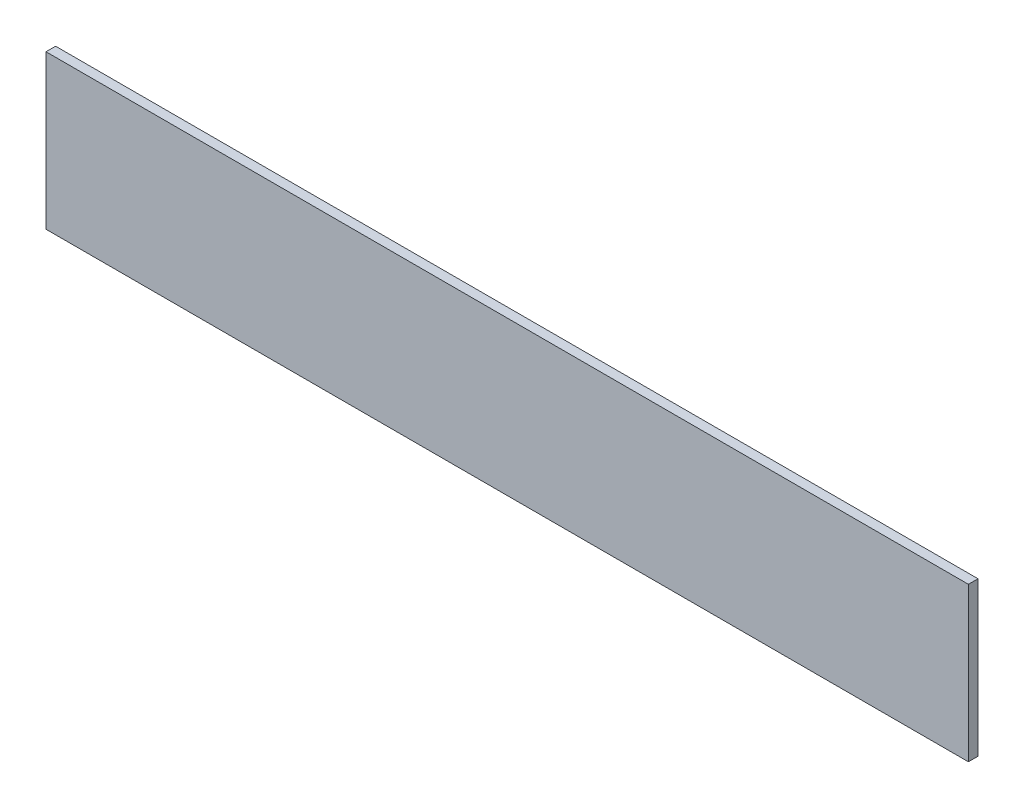
ISO-10303-21;
HEADER;
FILE_DESCRIPTION(('STEP AP214'),'2;1');
FILE_NAME('part.step','',(''),(''),'','','');
FILE_SCHEMA(('AUTOMOTIVE_DESIGN { 1 0 10303 214 1 1 1 1 }'));
ENDSEC;
DATA;
#1=APPLICATION_CONTEXT('core data for automotive mechanical design processes');
#2=APPLICATION_PROTOCOL_DEFINITION('international standard','automotive_design',2000,#1);
#3=PRODUCT_CONTEXT('',#1,'mechanical');
#4=PRODUCT('Part','Part','',(#3));
#5=PRODUCT_RELATED_PRODUCT_CATEGORY('part','',(#4));
#6=PRODUCT_DEFINITION_FORMATION('','',#4);
#7=PRODUCT_DEFINITION_CONTEXT('part definition',#1,'design');
#8=PRODUCT_DEFINITION('design','',#6,#7);
#9=PRODUCT_DEFINITION_SHAPE('','',#8);
#10=(LENGTH_UNIT() NAMED_UNIT(*) SI_UNIT(.MILLI.,.METRE.));
#11=(NAMED_UNIT(*) PLANE_ANGLE_UNIT() SI_UNIT($,.RADIAN.));
#12=(NAMED_UNIT(*) SI_UNIT($,.STERADIAN.) SOLID_ANGLE_UNIT());
#13=UNCERTAINTY_MEASURE_WITH_UNIT(LENGTH_MEASURE(1.E-05),#10,'distance_accuracy_value','');
#14=(GEOMETRIC_REPRESENTATION_CONTEXT(3) GLOBAL_UNCERTAINTY_ASSIGNED_CONTEXT((#13)) GLOBAL_UNIT_ASSIGNED_CONTEXT((#10,
#11,#12)) REPRESENTATION_CONTEXT('',''));
#15=CARTESIAN_POINT('',(0.,0.,0.));
#16=DIRECTION('',(0.,0.,1.));
#17=DIRECTION('',(1.,0.,0.));
#18=AXIS2_PLACEMENT_3D('',#15,#16,#17);
#19=CARTESIAN_POINT('',(152.4,-25.4,3.175));
#20=DIRECTION('',(-1.,0.,0.));
#21=DIRECTION('',(0.,0.,1.));
#22=AXIS2_PLACEMENT_3D('',#19,#20,#21);
#23=PLANE('',#22);
#24=DIRECTION('',(0.,1.,0.));
#25=VECTOR('',#24,1.);
#26=CARTESIAN_POINT('',(152.4,-25.4,0.));
#27=LINE('',#26,#25);
#28=CARTESIAN_POINT('',(152.4,-25.4,0.));
#29=VERTEX_POINT('',#28);
#30=CARTESIAN_POINT('',(152.4,25.4,0.));
#31=VERTEX_POINT('',#30);
#32=EDGE_CURVE('E105',#29,#31,#27,.T.);
#33=ORIENTED_EDGE('',*,*,#32,.T.);
#34=DIRECTION('',(0.,0.,-1.));
#35=VECTOR('',#34,1.);
#36=CARTESIAN_POINT('',(152.4,25.4,3.175));
#37=LINE('',#36,#35);
#38=CARTESIAN_POINT('',(152.4,25.4,3.175));
#39=VERTEX_POINT('',#38);
#40=EDGE_CURVE('E11',#39,#31,#37,.T.);
#41=ORIENTED_EDGE('',*,*,#40,.F.);
#42=DIRECTION('',(0.,1.,0.));
#43=VECTOR('',#42,1.);
#44=CARTESIAN_POINT('',(152.4,-25.4,3.175));
#45=LINE('',#44,#43);
#46=CARTESIAN_POINT('',(152.4,-25.4,3.175));
#47=VERTEX_POINT('',#46);
#48=EDGE_CURVE('E93',#47,#39,#45,.T.);
#49=ORIENTED_EDGE('',*,*,#48,.F.);
#50=DIRECTION('',(0.,0.,-1.));
#51=VECTOR('',#50,1.);
#52=CARTESIAN_POINT('',(152.4,-25.4,3.175));
#53=LINE('',#52,#51);
#54=EDGE_CURVE('E101',#47,#29,#53,.T.);
#55=ORIENTED_EDGE('',*,*,#54,.T.);
#56=EDGE_LOOP('',(#33,#41,#49,#55));
#57=FACE_BOUND('',#56,.T.);
#58=ADVANCED_FACE('F42',(#57),#23,.F.);
#59=CARTESIAN_POINT('',(-152.4,25.4,3.175));
#60=DIRECTION('',(0.,-1.,0.));
#61=DIRECTION('',(0.,0.,-1.));
#62=AXIS2_PLACEMENT_3D('',#59,#60,#61);
#63=PLANE('',#62);
#64=DIRECTION('',(-1.,0.,0.));
#65=VECTOR('',#64,1.);
#66=CARTESIAN_POINT('',(-152.4,25.4,0.));
#67=LINE('',#66,#65);
#68=CARTESIAN_POINT('',(-152.4,25.4,0.));
#69=VERTEX_POINT('',#68);
#70=EDGE_CURVE('E97',#31,#69,#67,.T.);
#71=ORIENTED_EDGE('',*,*,#70,.T.);
#72=DIRECTION('',(0.,0.,-1.));
#73=VECTOR('',#72,1.);
#74=CARTESIAN_POINT('',(-152.4,25.4,3.175));
#75=LINE('',#74,#73);
#76=CARTESIAN_POINT('',(-152.4,25.4,3.175));
#77=VERTEX_POINT('',#76);
#78=EDGE_CURVE('E50',#77,#69,#75,.T.);
#79=ORIENTED_EDGE('',*,*,#78,.F.);
#80=DIRECTION('',(-1.,0.,0.));
#81=VECTOR('',#80,1.);
#82=CARTESIAN_POINT('',(-152.4,25.4,3.175));
#83=LINE('',#82,#81);
#84=EDGE_CURVE('E88',#39,#77,#83,.T.);
#85=ORIENTED_EDGE('',*,*,#84,.F.);
#86=ORIENTED_EDGE('',*,*,#40,.T.);
#87=EDGE_LOOP('',(#71,#79,#85,#86));
#88=FACE_BOUND('',#87,.T.);
#89=ADVANCED_FACE('F96',(#88),#63,.F.);
#90=CARTESIAN_POINT('',(-152.4,-25.4,3.175));
#91=DIRECTION('',(1.,0.,0.));
#92=DIRECTION('',(0.,0.,-1.));
#93=AXIS2_PLACEMENT_3D('',#90,#91,#92);
#94=PLANE('',#93);
#95=DIRECTION('',(0.,-1.,0.));
#96=VECTOR('',#95,1.);
#97=CARTESIAN_POINT('',(-152.4,-25.4,0.));
#98=LINE('',#97,#96);
#99=CARTESIAN_POINT('',(-152.4,-25.4,0.));
#100=VERTEX_POINT('',#99);
#101=EDGE_CURVE('E75',#69,#100,#98,.T.);
#102=ORIENTED_EDGE('',*,*,#101,.T.);
#103=DIRECTION('',(0.,0.,-1.));
#104=VECTOR('',#103,1.);
#105=CARTESIAN_POINT('',(-152.4,-25.4,3.175));
#106=LINE('',#105,#104);
#107=CARTESIAN_POINT('',(-152.4,-25.4,3.175));
#108=VERTEX_POINT('',#107);
#109=EDGE_CURVE('E98',#108,#100,#106,.T.);
#110=ORIENTED_EDGE('',*,*,#109,.F.);
#111=DIRECTION('',(0.,-1.,0.));
#112=VECTOR('',#111,1.);
#113=CARTESIAN_POINT('',(-152.4,-25.4,3.175));
#114=LINE('',#113,#112);
#115=EDGE_CURVE('E91',#77,#108,#114,.T.);
#116=ORIENTED_EDGE('',*,*,#115,.F.);
#117=ORIENTED_EDGE('',*,*,#78,.T.);
#118=EDGE_LOOP('',(#102,#110,#116,#117));
#119=FACE_BOUND('',#118,.T.);
#120=ADVANCED_FACE('F99',(#119),#94,.F.);
#121=CARTESIAN_POINT('',(-152.4,-25.4,3.175));
#122=DIRECTION('',(0.,1.,0.));
#123=DIRECTION('',(0.,0.,1.));
#124=AXIS2_PLACEMENT_3D('',#121,#122,#123);
#125=PLANE('',#124);
#126=DIRECTION('',(1.,0.,0.));
#127=VECTOR('',#126,1.);
#128=CARTESIAN_POINT('',(-152.4,-25.4,0.));
#129=LINE('',#128,#127);
#130=EDGE_CURVE('E81',#100,#29,#129,.T.);
#131=ORIENTED_EDGE('',*,*,#130,.T.);
#132=ORIENTED_EDGE('',*,*,#54,.F.);
#133=DIRECTION('',(1.,0.,0.));
#134=VECTOR('',#133,1.);
#135=CARTESIAN_POINT('',(-152.4,-25.4,3.175));
#136=LINE('',#135,#134);
#137=EDGE_CURVE('E58',#108,#47,#136,.T.);
#138=ORIENTED_EDGE('',*,*,#137,.F.);
#139=ORIENTED_EDGE('',*,*,#109,.T.);
#140=EDGE_LOOP('',(#131,#132,#138,#139));
#141=FACE_BOUND('',#140,.T.);
#142=ADVANCED_FACE('F112',(#141),#125,.F.);
#143=CARTESIAN_POINT('',(0.,0.,3.175));
#144=DIRECTION('',(0.,0.,-1.));
#145=DIRECTION('',(-1.,0.,0.));
#146=AXIS2_PLACEMENT_3D('',#143,#144,#145);
#147=PLANE('',#146);
#148=ORIENTED_EDGE('',*,*,#48,.T.);
#149=ORIENTED_EDGE('',*,*,#84,.T.);
#150=ORIENTED_EDGE('',*,*,#115,.T.);
#151=ORIENTED_EDGE('',*,*,#137,.T.);
#152=EDGE_LOOP('',(#148,#149,#150,#151));
#153=FACE_BOUND('',#152,.T.);
#154=ADVANCED_FACE('F89',(#153),#147,.F.);
#155=CARTESIAN_POINT('',(0.,0.,0.));
#156=DIRECTION('',(0.,0.,-1.));
#157=DIRECTION('',(-1.,0.,0.));
#158=AXIS2_PLACEMENT_3D('',#155,#156,#157);
#159=PLANE('',#158);
#160=ORIENTED_EDGE('',*,*,#32,.F.);
#161=ORIENTED_EDGE('',*,*,#130,.F.);
#162=ORIENTED_EDGE('',*,*,#101,.F.);
#163=ORIENTED_EDGE('',*,*,#70,.F.);
#164=EDGE_LOOP('',(#160,#161,#162,#163));
#165=FACE_BOUND('',#164,.T.);
#166=ADVANCED_FACE('F115',(#165),#159,.T.);
#167=CLOSED_SHELL('',(#58,#89,#120,#142,#154,#166));
#168=MANIFOLD_SOLID_BREP('B2',#167);
#169=ADVANCED_BREP_SHAPE_REPRESENTATION('',(#18,#168),#14);
#170=SHAPE_DEFINITION_REPRESENTATION(#9,#169);
ENDSEC;
END-ISO-10303-21;
